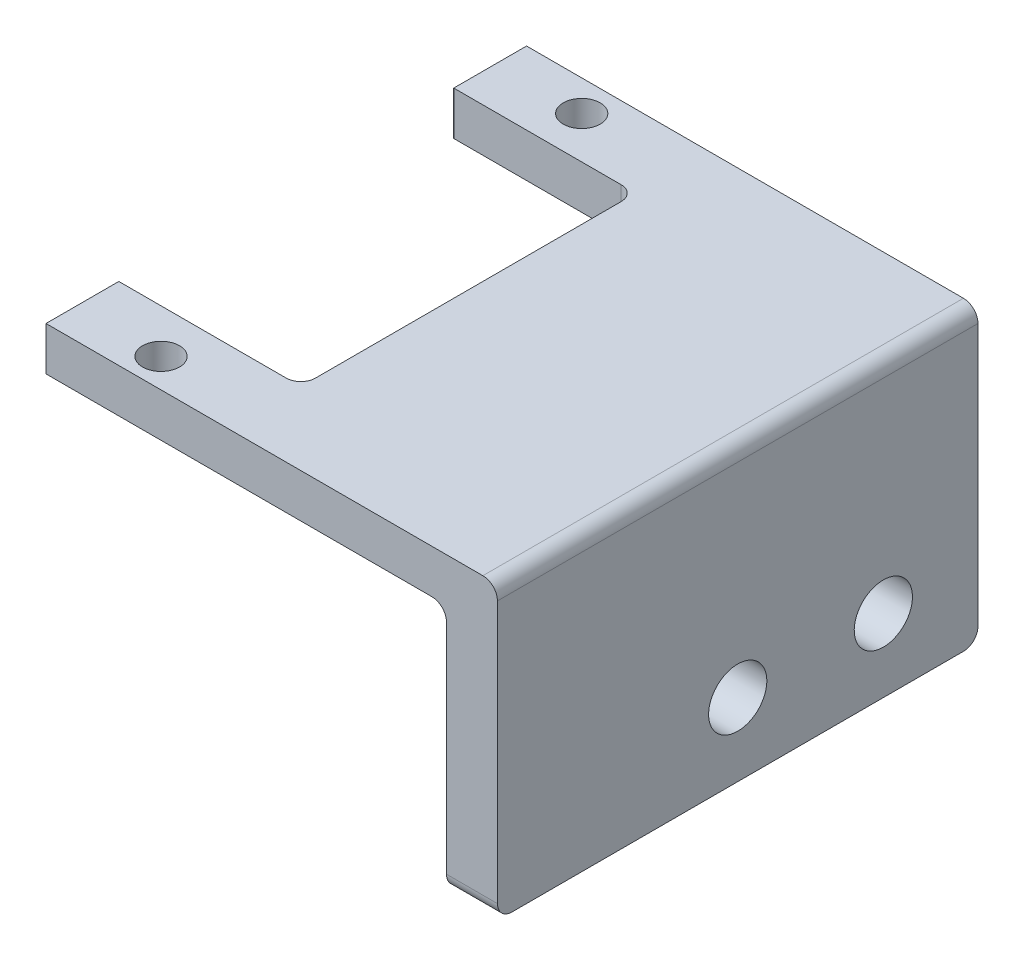
ISO-10303-21;
HEADER;
FILE_DESCRIPTION(('STEP AP214'),'2;1');
FILE_NAME('part.step','',(''),(''),'','','');
FILE_SCHEMA(('AUTOMOTIVE_DESIGN { 1 0 10303 214 1 1 1 1 }'));
ENDSEC;
DATA;
#1=APPLICATION_CONTEXT('core data for automotive mechanical design processes');
#2=APPLICATION_PROTOCOL_DEFINITION('international standard','automotive_design',2000,#1);
#3=PRODUCT_CONTEXT('',#1,'mechanical');
#4=PRODUCT('Part','Part','',(#3));
#5=PRODUCT_RELATED_PRODUCT_CATEGORY('part','',(#4));
#6=PRODUCT_DEFINITION_FORMATION('','',#4);
#7=PRODUCT_DEFINITION_CONTEXT('part definition',#1,'design');
#8=PRODUCT_DEFINITION('design','',#6,#7);
#9=PRODUCT_DEFINITION_SHAPE('','',#8);
#10=(LENGTH_UNIT() NAMED_UNIT(*) SI_UNIT(.MILLI.,.METRE.));
#11=(NAMED_UNIT(*) PLANE_ANGLE_UNIT() SI_UNIT($,.RADIAN.));
#12=(NAMED_UNIT(*) SI_UNIT($,.STERADIAN.) SOLID_ANGLE_UNIT());
#13=UNCERTAINTY_MEASURE_WITH_UNIT(LENGTH_MEASURE(1.E-05),#10,'distance_accuracy_value','');
#14=(GEOMETRIC_REPRESENTATION_CONTEXT(3) GLOBAL_UNCERTAINTY_ASSIGNED_CONTEXT((#13)) GLOBAL_UNIT_ASSIGNED_CONTEXT((#10,
#11,#12)) REPRESENTATION_CONTEXT('',''));
#15=CARTESIAN_POINT('',(0.,0.,0.));
#16=DIRECTION('',(0.,0.,1.));
#17=DIRECTION('',(1.,0.,0.));
#18=AXIS2_PLACEMENT_3D('',#15,#16,#17);
#19=CARTESIAN_POINT('',(12.5,-22.1732019458601,0.));
#20=DIRECTION('',(-1.,0.,0.));
#21=DIRECTION('',(0.,-1.,0.));
#22=AXIS2_PLACEMENT_3D('',#19,#20,#21);
#23=PLANE('',#22);
#24=DIRECTION('',(0.,0.,-1.));
#25=VECTOR('',#24,1.);
#26=CARTESIAN_POINT('',(12.5,-5.17320194586012,33.));
#27=LINE('',#26,#25);
#28=CARTESIAN_POINT('',(12.5,-5.17320194586012,27.));
#29=VERTEX_POINT('',#28);
#30=CARTESIAN_POINT('',(12.5,-5.17320194586012,6.));
#31=VERTEX_POINT('',#30);
#32=EDGE_CURVE('E299',#29,#31,#27,.T.);
#33=ORIENTED_EDGE('',*,*,#32,.F.);
#34=DIRECTION('',(0.,1.,0.));
#35=VECTOR('',#34,1.);
#36=CARTESIAN_POINT('',(12.5,-22.1732019458601,27.));
#37=LINE('',#36,#35);
#38=CARTESIAN_POINT('',(12.5,-2.17320194586011,27.));
#39=VERTEX_POINT('',#38);
#40=EDGE_CURVE('E254',#29,#39,#37,.T.);
#41=ORIENTED_EDGE('',*,*,#40,.T.);
#42=DIRECTION('',(0.,0.,1.));
#43=VECTOR('',#42,1.);
#44=CARTESIAN_POINT('',(12.5,-2.17320194586011,0.));
#45=LINE('',#44,#43);
#46=CARTESIAN_POINT('',(12.5,-2.17320194586011,6.));
#47=VERTEX_POINT('',#46);
#48=EDGE_CURVE('E196',#47,#39,#45,.T.);
#49=ORIENTED_EDGE('',*,*,#48,.F.);
#50=DIRECTION('',(0.,1.,0.));
#51=VECTOR('',#50,1.);
#52=CARTESIAN_POINT('',(12.5,-22.1732019458601,6.));
#53=LINE('',#52,#51);
#54=EDGE_CURVE('E252',#47,#31,#53,.F.);
#55=ORIENTED_EDGE('',*,*,#54,.T.);
#56=EDGE_LOOP('',(#33,#41,#49,#55));
#57=FACE_BOUND('',#56,.T.);
#58=ADVANCED_FACE('F39',(#57),#23,.T.);
#59=CARTESIAN_POINT('',(0.,-2.17320194586011,0.));
#60=DIRECTION('',(0.,1.,0.));
#61=DIRECTION('',(-1.,0.,0.));
#62=AXIS2_PLACEMENT_3D('',#59,#60,#61);
#63=PLANE('',#62);
#64=DIRECTION('',(1.,0.,0.));
#65=VECTOR('',#64,1.);
#66=CARTESIAN_POINT('',(0.,-2.17320194586011,33.));
#67=LINE('',#66,#65);
#68=CARTESIAN_POINT('',(0.,-2.17320194586011,33.));
#69=VERTEX_POINT('',#68);
#70=CARTESIAN_POINT('',(30.,-2.17320194586012,33.));
#71=VERTEX_POINT('',#70);
#72=EDGE_CURVE('E191',#69,#71,#67,.T.);
#73=ORIENTED_EDGE('',*,*,#72,.T.);
#74=DIRECTION('',(0.,0.,1.));
#75=VECTOR('',#74,1.);
#76=CARTESIAN_POINT('',(30.,-2.17320194586012,0.));
#77=LINE('',#76,#75);
#78=CARTESIAN_POINT('',(30.,-2.17320194586012,0.));
#79=VERTEX_POINT('',#78);
#80=EDGE_CURVE('E246',#71,#79,#77,.F.);
#81=ORIENTED_EDGE('',*,*,#80,.T.);
#82=DIRECTION('',(-1.,0.,0.));
#83=VECTOR('',#82,1.);
#84=CARTESIAN_POINT('',(0.,-2.17320194586011,0.));
#85=LINE('',#84,#83);
#86=CARTESIAN_POINT('',(0.,-2.17320194586011,0.));
#87=VERTEX_POINT('',#86);
#88=EDGE_CURVE('E220',#79,#87,#85,.T.);
#89=ORIENTED_EDGE('',*,*,#88,.T.);
#90=DIRECTION('',(0.,0.,1.));
#91=VECTOR('',#90,1.);
#92=CARTESIAN_POINT('',(0.,-2.17320194586011,0.));
#93=LINE('',#92,#91);
#94=CARTESIAN_POINT('',(0.,-2.17320194586011,5.));
#95=VERTEX_POINT('',#94);
#96=EDGE_CURVE('E213',#87,#95,#93,.T.);
#97=ORIENTED_EDGE('',*,*,#96,.T.);
#98=DIRECTION('',(1.,0.,0.));
#99=VECTOR('',#98,1.);
#100=CARTESIAN_POINT('',(0.,-2.17320194586011,5.));
#101=LINE('',#100,#99);
#102=CARTESIAN_POINT('',(11.5,-2.17320194586011,5.));
#103=VERTEX_POINT('',#102);
#104=EDGE_CURVE('E216',#95,#103,#101,.T.);
#105=ORIENTED_EDGE('',*,*,#104,.T.);
#106=CARTESIAN_POINT('',(11.5,-2.17320194586011,6.));
#107=DIRECTION('',(0.,1.,0.));
#108=DIRECTION('',(-1.,0.,0.));
#109=AXIS2_PLACEMENT_3D('',#106,#107,#108);
#110=CIRCLE('',#109,1.);
#111=EDGE_CURVE('E277',#103,#47,#110,.F.);
#112=ORIENTED_EDGE('',*,*,#111,.T.);
#113=ORIENTED_EDGE('',*,*,#48,.T.);
#114=CARTESIAN_POINT('',(11.5,-2.17320194586011,27.));
#115=DIRECTION('',(0.,1.,0.));
#116=DIRECTION('',(-1.,0.,0.));
#117=AXIS2_PLACEMENT_3D('',#114,#115,#116);
#118=CIRCLE('',#117,1.);
#119=CARTESIAN_POINT('',(11.5,-2.17320194586011,28.));
#120=VERTEX_POINT('',#119);
#121=EDGE_CURVE('E273',#39,#120,#118,.F.);
#122=ORIENTED_EDGE('',*,*,#121,.T.);
#123=DIRECTION('',(-1.,0.,0.));
#124=VECTOR('',#123,1.);
#125=CARTESIAN_POINT('',(0.,-2.17320194586011,28.));
#126=LINE('',#125,#124);
#127=CARTESIAN_POINT('',(0.,-2.17320194586011,28.));
#128=VERTEX_POINT('',#127);
#129=EDGE_CURVE('E173',#120,#128,#126,.T.);
#130=ORIENTED_EDGE('',*,*,#129,.T.);
#131=DIRECTION('',(0.,0.,1.));
#132=VECTOR('',#131,1.);
#133=CARTESIAN_POINT('',(0.,-2.17320194586011,28.));
#134=LINE('',#133,#132);
#135=EDGE_CURVE('E165',#128,#69,#134,.T.);
#136=ORIENTED_EDGE('',*,*,#135,.T.);
#137=EDGE_LOOP('',(#73,#81,#89,#97,#105,#112,#113,#122,#130,#136));
#138=FACE_BOUND('',#137,.T.);
#139=CARTESIAN_POINT('',(5.90643397731527,-2.17320194586011,31.0075194618769));
#140=DIRECTION('',(0.,1.,0.));
#141=DIRECTION('',(-1.,0.,0.));
#142=AXIS2_PLACEMENT_3D('',#139,#140,#141);
#143=CIRCLE('',#142,1.27);
#144=CARTESIAN_POINT('',(4.63643397731528,-2.17320194586011,31.0075194618769));
#145=VERTEX_POINT('',#144);
#146=EDGE_CURVE('E181',#145,#145,#143,.T.);
#147=ORIENTED_EDGE('',*,*,#146,.F.);
#148=EDGE_LOOP('',(#147));
#149=FACE_BOUND('',#148,.T.);
#150=CARTESIAN_POINT('',(5.90643397731527,-2.17320194586011,2.11948053812313));
#151=DIRECTION('',(0.,1.,0.));
#152=DIRECTION('',(-1.,0.,0.));
#153=AXIS2_PLACEMENT_3D('',#150,#151,#152);
#154=CIRCLE('',#153,1.27);
#155=CARTESIAN_POINT('',(4.63643397731527,-2.17320194586011,2.11948053812313));
#156=VERTEX_POINT('',#155);
#157=EDGE_CURVE('E207',#156,#156,#154,.T.);
#158=ORIENTED_EDGE('',*,*,#157,.F.);
#159=EDGE_LOOP('',(#158));
#160=FACE_BOUND('',#159,.T.);
#161=ADVANCED_FACE('F313',(#138,#149,#160),#63,.T.);
#162=CARTESIAN_POINT('',(0.,-5.17320194586011,0.));
#163=DIRECTION('',(0.,1.,0.));
#164=DIRECTION('',(-1.,0.,0.));
#165=AXIS2_PLACEMENT_3D('',#162,#163,#164);
#166=PLANE('',#165);
#167=DIRECTION('',(-1.,0.,0.));
#168=VECTOR('',#167,1.);
#169=CARTESIAN_POINT('',(0.,-5.17320194586011,0.));
#170=LINE('',#169,#168);
#171=CARTESIAN_POINT('',(26.5,-5.17320194586012,0.));
#172=VERTEX_POINT('',#171);
#173=CARTESIAN_POINT('',(0.,-5.17320194586011,0.));
#174=VERTEX_POINT('',#173);
#175=EDGE_CURVE('E217',#172,#174,#170,.T.);
#176=ORIENTED_EDGE('',*,*,#175,.F.);
#177=DIRECTION('',(0.,0.,-1.));
#178=VECTOR('',#177,1.);
#179=CARTESIAN_POINT('',(26.5,-5.17320194586012,33.));
#180=LINE('',#179,#178);
#181=CARTESIAN_POINT('',(26.5,-5.17320194586012,33.));
#182=VERTEX_POINT('',#181);
#183=EDGE_CURVE('E271',#172,#182,#180,.F.);
#184=ORIENTED_EDGE('',*,*,#183,.T.);
#185=DIRECTION('',(1.,0.,0.));
#186=VECTOR('',#185,1.);
#187=CARTESIAN_POINT('',(0.,-5.17320194586011,33.));
#188=LINE('',#187,#186);
#189=CARTESIAN_POINT('',(0.,-5.17320194586011,33.));
#190=VERTEX_POINT('',#189);
#191=EDGE_CURVE('E164',#190,#182,#188,.T.);
#192=ORIENTED_EDGE('',*,*,#191,.F.);
#193=DIRECTION('',(0.,0.,1.));
#194=VECTOR('',#193,1.);
#195=CARTESIAN_POINT('',(0.,-5.17320194586011,28.));
#196=LINE('',#195,#194);
#197=CARTESIAN_POINT('',(0.,-5.17320194586011,28.));
#198=VERTEX_POINT('',#197);
#199=EDGE_CURVE('E171',#198,#190,#196,.T.);
#200=ORIENTED_EDGE('',*,*,#199,.F.);
#201=DIRECTION('',(-1.,0.,0.));
#202=VECTOR('',#201,1.);
#203=CARTESIAN_POINT('',(0.,-5.17320194586011,28.));
#204=LINE('',#203,#202);
#205=CARTESIAN_POINT('',(11.5,-5.17320194586011,28.));
#206=VERTEX_POINT('',#205);
#207=EDGE_CURVE('E153',#206,#198,#204,.T.);
#208=ORIENTED_EDGE('',*,*,#207,.F.);
#209=CARTESIAN_POINT('',(11.5,-5.17320194586011,27.));
#210=DIRECTION('',(0.,1.,0.));
#211=DIRECTION('',(-1.,0.,0.));
#212=AXIS2_PLACEMENT_3D('',#209,#210,#211);
#213=CIRCLE('',#212,1.);
#214=EDGE_CURVE('E275',#206,#29,#213,.T.);
#215=ORIENTED_EDGE('',*,*,#214,.T.);
#216=ORIENTED_EDGE('',*,*,#32,.T.);
#217=CARTESIAN_POINT('',(11.5,-5.17320194586011,6.));
#218=DIRECTION('',(0.,1.,0.));
#219=DIRECTION('',(-1.,0.,0.));
#220=AXIS2_PLACEMENT_3D('',#217,#218,#219);
#221=CIRCLE('',#220,1.);
#222=CARTESIAN_POINT('',(11.5,-5.17320194586011,5.));
#223=VERTEX_POINT('',#222);
#224=EDGE_CURVE('E279',#31,#223,#221,.T.);
#225=ORIENTED_EDGE('',*,*,#224,.T.);
#226=DIRECTION('',(1.,0.,0.));
#227=VECTOR('',#226,1.);
#228=CARTESIAN_POINT('',(0.,-5.17320194586011,5.));
#229=LINE('',#228,#227);
#230=CARTESIAN_POINT('',(0.,-5.17320194586011,5.));
#231=VERTEX_POINT('',#230);
#232=EDGE_CURVE('E225',#231,#223,#229,.T.);
#233=ORIENTED_EDGE('',*,*,#232,.F.);
#234=DIRECTION('',(0.,0.,1.));
#235=VECTOR('',#234,1.);
#236=CARTESIAN_POINT('',(0.,-5.17320194586011,0.));
#237=LINE('',#236,#235);
#238=EDGE_CURVE('E210',#174,#231,#237,.T.);
#239=ORIENTED_EDGE('',*,*,#238,.F.);
#240=EDGE_LOOP('',(#176,#184,#192,#200,#208,#215,#216,#225,#233,#239));
#241=FACE_BOUND('',#240,.T.);
#242=CARTESIAN_POINT('',(5.90643397731527,-5.17320194586011,2.11948053812313));
#243=DIRECTION('',(0.,1.,0.));
#244=DIRECTION('',(-1.,0.,0.));
#245=AXIS2_PLACEMENT_3D('',#242,#243,#244);
#246=CIRCLE('',#245,1.27);
#247=CARTESIAN_POINT('',(4.63643397731527,-5.17320194586011,2.11948053812313));
#248=VERTEX_POINT('',#247);
#249=EDGE_CURVE('E204',#248,#248,#246,.T.);
#250=ORIENTED_EDGE('',*,*,#249,.T.);
#251=EDGE_LOOP('',(#250));
#252=FACE_BOUND('',#251,.T.);
#253=CARTESIAN_POINT('',(5.90643397731527,-5.17320194586011,31.0075194618769));
#254=DIRECTION('',(0.,1.,0.));
#255=DIRECTION('',(-1.,0.,0.));
#256=AXIS2_PLACEMENT_3D('',#253,#254,#255);
#257=CIRCLE('',#256,1.27);
#258=CARTESIAN_POINT('',(4.63643397731528,-5.17320194586011,31.0075194618769));
#259=VERTEX_POINT('',#258);
#260=EDGE_CURVE('E184',#259,#259,#257,.T.);
#261=ORIENTED_EDGE('',*,*,#260,.T.);
#262=EDGE_LOOP('',(#261));
#263=FACE_BOUND('',#262,.T.);
#264=ADVANCED_FACE('F177',(#241,#252,#263),#166,.F.);
#265=CARTESIAN_POINT('',(0.,-2.17320194586011,0.));
#266=DIRECTION('',(1.,0.,0.));
#267=DIRECTION('',(0.,1.,0.));
#268=AXIS2_PLACEMENT_3D('',#265,#266,#267);
#269=PLANE('',#268);
#270=ORIENTED_EDGE('',*,*,#238,.T.);
#271=DIRECTION('',(0.,-1.,0.));
#272=VECTOR('',#271,1.);
#273=CARTESIAN_POINT('',(0.,-2.17320194586011,5.));
#274=LINE('',#273,#272);
#275=EDGE_CURVE('E231',#95,#231,#274,.T.);
#276=ORIENTED_EDGE('',*,*,#275,.F.);
#277=ORIENTED_EDGE('',*,*,#96,.F.);
#278=DIRECTION('',(0.,-1.,0.));
#279=VECTOR('',#278,1.);
#280=CARTESIAN_POINT('',(0.,-2.17320194586011,0.));
#281=LINE('',#280,#279);
#282=EDGE_CURVE('E222',#87,#174,#281,.T.);
#283=ORIENTED_EDGE('',*,*,#282,.T.);
#284=EDGE_LOOP('',(#270,#276,#277,#283));
#285=FACE_BOUND('',#284,.T.);
#286=ADVANCED_FACE('F331',(#285),#269,.F.);
#287=CARTESIAN_POINT('',(0.,-2.17320194586011,5.));
#288=DIRECTION('',(0.,0.,-1.));
#289=DIRECTION('',(-1.,0.,0.));
#290=AXIS2_PLACEMENT_3D('',#287,#288,#289);
#291=PLANE('',#290);
#292=ORIENTED_EDGE('',*,*,#232,.T.);
#293=DIRECTION('',(0.,1.,0.));
#294=VECTOR('',#293,1.);
#295=CARTESIAN_POINT('',(11.5,-2.17320194586011,5.));
#296=LINE('',#295,#294);
#297=EDGE_CURVE('E258',#223,#103,#296,.T.);
#298=ORIENTED_EDGE('',*,*,#297,.T.);
#299=ORIENTED_EDGE('',*,*,#104,.F.);
#300=ORIENTED_EDGE('',*,*,#275,.T.);
#301=EDGE_LOOP('',(#292,#298,#299,#300));
#302=FACE_BOUND('',#301,.T.);
#303=ADVANCED_FACE('F327',(#302),#291,.F.);
#304=CARTESIAN_POINT('',(0.,-2.17320194586011,0.));
#305=DIRECTION('',(0.,0.,1.));
#306=DIRECTION('',(1.,0.,0.));
#307=AXIS2_PLACEMENT_3D('',#304,#305,#306);
#308=PLANE('',#307);
#309=ORIENTED_EDGE('',*,*,#88,.F.);
#310=CARTESIAN_POINT('',(30.,-3.17320194586012,0.));
#311=DIRECTION('',(0.,0.,1.));
#312=DIRECTION('',(1.,0.,0.));
#313=AXIS2_PLACEMENT_3D('',#310,#311,#312);
#314=CIRCLE('',#313,1.);
#315=CARTESIAN_POINT('',(31.,-3.17320194586012,0.));
#316=VERTEX_POINT('',#315);
#317=EDGE_CURVE('E250',#79,#316,#314,.F.);
#318=ORIENTED_EDGE('',*,*,#317,.T.);
#319=DIRECTION('',(0.,1.,0.));
#320=VECTOR('',#319,1.);
#321=CARTESIAN_POINT('',(31.,-22.1732019458601,0.));
#322=LINE('',#321,#320);
#323=CARTESIAN_POINT('',(31.,-21.1732019458601,0.));
#324=VERTEX_POINT('',#323);
#325=EDGE_CURVE('E201',#324,#316,#322,.T.);
#326=ORIENTED_EDGE('',*,*,#325,.F.);
#327=DIRECTION('',(1.,0.,0.));
#328=VECTOR('',#327,1.);
#329=CARTESIAN_POINT('',(0.,-21.1732019458601,0.));
#330=LINE('',#329,#328);
#331=CARTESIAN_POINT('',(27.5,-21.1732019458601,0.));
#332=VERTEX_POINT('',#331);
#333=EDGE_CURVE('E248',#324,#332,#330,.F.);
#334=ORIENTED_EDGE('',*,*,#333,.T.);
#335=DIRECTION('',(0.,-1.,0.));
#336=VECTOR('',#335,1.);
#337=CARTESIAN_POINT('',(27.5,-22.1732019458601,0.));
#338=LINE('',#337,#336);
#339=CARTESIAN_POINT('',(27.5,-6.17320194586012,0.));
#340=VERTEX_POINT('',#339);
#341=EDGE_CURVE('E285',#340,#332,#338,.T.);
#342=ORIENTED_EDGE('',*,*,#341,.F.);
#343=CARTESIAN_POINT('',(26.5,-6.17320194586012,0.));
#344=DIRECTION('',(0.,0.,1.));
#345=DIRECTION('',(1.,0.,0.));
#346=AXIS2_PLACEMENT_3D('',#343,#344,#345);
#347=CIRCLE('',#346,1.);
#348=EDGE_CURVE('E47',#340,#172,#347,.T.);
#349=ORIENTED_EDGE('',*,*,#348,.T.);
#350=ORIENTED_EDGE('',*,*,#175,.T.);
#351=ORIENTED_EDGE('',*,*,#282,.F.);
#352=EDGE_LOOP('',(#309,#318,#326,#334,#342,#349,#350,#351));
#353=FACE_BOUND('',#352,.T.);
#354=ADVANCED_FACE('F283',(#353),#308,.F.);
#355=CARTESIAN_POINT('',(5.90643397731527,-2.17320194586011,2.11948053812313));
#356=DIRECTION('',(0.,-1.,0.));
#357=DIRECTION('',(1.,0.,0.));
#358=AXIS2_PLACEMENT_3D('',#355,#356,#357);
#359=CYLINDRICAL_SURFACE('',#358,1.27);
#360=ORIENTED_EDGE('',*,*,#157,.T.);
#361=EDGE_LOOP('',(#360));
#362=FACE_BOUND('',#361,.T.);
#363=ORIENTED_EDGE('',*,*,#249,.F.);
#364=EDGE_LOOP('',(#363));
#365=FACE_BOUND('',#364,.T.);
#366=ADVANCED_FACE('F369',(#362,#365),#359,.F.);
#367=CARTESIAN_POINT('',(0.,-22.1732019458601,33.));
#368=DIRECTION('',(0.,0.,1.));
#369=DIRECTION('',(0.,-1.,0.));
#370=AXIS2_PLACEMENT_3D('',#367,#368,#369);
#371=PLANE('',#370);
#372=DIRECTION('',(0.,1.,0.));
#373=VECTOR('',#372,1.);
#374=CARTESIAN_POINT('',(31.,-22.1732019458601,33.));
#375=LINE('',#374,#373);
#376=CARTESIAN_POINT('',(31.,-21.1732019458601,33.));
#377=VERTEX_POINT('',#376);
#378=CARTESIAN_POINT('',(31.,-3.17320194586012,33.));
#379=VERTEX_POINT('',#378);
#380=EDGE_CURVE('E195',#377,#379,#375,.T.);
#381=ORIENTED_EDGE('',*,*,#380,.T.);
#382=CARTESIAN_POINT('',(30.,-3.17320194586012,33.));
#383=DIRECTION('',(0.,0.,1.));
#384=DIRECTION('',(0.,-1.,0.));
#385=AXIS2_PLACEMENT_3D('',#382,#383,#384);
#386=CIRCLE('',#385,1.);
#387=EDGE_CURVE('E244',#379,#71,#386,.T.);
#388=ORIENTED_EDGE('',*,*,#387,.T.);
#389=ORIENTED_EDGE('',*,*,#72,.F.);
#390=DIRECTION('',(0.,-1.,0.));
#391=VECTOR('',#390,1.);
#392=CARTESIAN_POINT('',(0.,-2.17320194586011,33.));
#393=LINE('',#392,#391);
#394=EDGE_CURVE('E174',#69,#190,#393,.T.);
#395=ORIENTED_EDGE('',*,*,#394,.T.);
#396=ORIENTED_EDGE('',*,*,#191,.T.);
#397=CARTESIAN_POINT('',(26.5,-6.17320194586012,33.));
#398=DIRECTION('',(0.,0.,1.));
#399=DIRECTION('',(0.,-1.,0.));
#400=AXIS2_PLACEMENT_3D('',#397,#398,#399);
#401=CIRCLE('',#400,1.);
#402=CARTESIAN_POINT('',(27.5,-6.17320194586012,33.));
#403=VERTEX_POINT('',#402);
#404=EDGE_CURVE('E11',#182,#403,#401,.F.);
#405=ORIENTED_EDGE('',*,*,#404,.T.);
#406=DIRECTION('',(0.,-1.,0.));
#407=VECTOR('',#406,1.);
#408=CARTESIAN_POINT('',(27.5,-22.1732019458601,33.));
#409=LINE('',#408,#407);
#410=CARTESIAN_POINT('',(27.5,-21.1732019458601,33.));
#411=VERTEX_POINT('',#410);
#412=EDGE_CURVE('E295',#403,#411,#409,.T.);
#413=ORIENTED_EDGE('',*,*,#412,.T.);
#414=DIRECTION('',(1.,0.,0.));
#415=VECTOR('',#414,1.);
#416=CARTESIAN_POINT('',(31.,-21.1732019458601,33.));
#417=LINE('',#416,#415);
#418=EDGE_CURVE('E241',#411,#377,#417,.T.);
#419=ORIENTED_EDGE('',*,*,#418,.T.);
#420=EDGE_LOOP('',(#381,#388,#389,#395,#396,#405,#413,#419));
#421=FACE_BOUND('',#420,.T.);
#422=ADVANCED_FACE('F294',(#421),#371,.T.);
#423=CARTESIAN_POINT('',(31.,-22.1732019458601,0.));
#424=DIRECTION('',(-1.,0.,0.));
#425=DIRECTION('',(0.,-1.,0.));
#426=AXIS2_PLACEMENT_3D('',#423,#424,#425);
#427=PLANE('',#426);
#428=CARTESIAN_POINT('',(31.,-17.1732019458601,16.5));
#429=DIRECTION('',(-1.,0.,0.));
#430=DIRECTION('',(0.,-1.,0.));
#431=AXIS2_PLACEMENT_3D('',#428,#429,#430);
#432=CIRCLE('',#431,2.00000000000001);
#433=CARTESIAN_POINT('',(31.,-19.1732019458601,16.5));
#434=VERTEX_POINT('',#433);
#435=EDGE_CURVE('E304',#434,#434,#432,.T.);
#436=ORIENTED_EDGE('',*,*,#435,.T.);
#437=EDGE_LOOP('',(#436));
#438=FACE_BOUND('',#437,.T.);
#439=CARTESIAN_POINT('',(31.,-17.1732019458601,6.5));
#440=DIRECTION('',(-1.,0.,0.));
#441=DIRECTION('',(0.,-1.,0.));
#442=AXIS2_PLACEMENT_3D('',#439,#440,#441);
#443=CIRCLE('',#442,2.);
#444=CARTESIAN_POINT('',(31.,-19.1732019458601,6.5));
#445=VERTEX_POINT('',#444);
#446=EDGE_CURVE('E307',#445,#445,#443,.T.);
#447=ORIENTED_EDGE('',*,*,#446,.T.);
#448=EDGE_LOOP('',(#447));
#449=FACE_BOUND('',#448,.T.);
#450=ORIENTED_EDGE('',*,*,#325,.T.);
#451=DIRECTION('',(0.,0.,1.));
#452=VECTOR('',#451,1.);
#453=CARTESIAN_POINT('',(31.,-3.17320194586012,33.));
#454=LINE('',#453,#452);
#455=EDGE_CURVE('E238',#316,#379,#454,.T.);
#456=ORIENTED_EDGE('',*,*,#455,.T.);
#457=ORIENTED_EDGE('',*,*,#380,.F.);
#458=CARTESIAN_POINT('',(31.,-21.1732019458601,32.));
#459=DIRECTION('',(-1.,0.,0.));
#460=DIRECTION('',(0.,-1.,0.));
#461=AXIS2_PLACEMENT_3D('',#458,#459,#460);
#462=CIRCLE('',#461,1.);
#463=CARTESIAN_POINT('',(31.,-22.1732019458601,32.));
#464=VERTEX_POINT('',#463);
#465=EDGE_CURVE('E234',#377,#464,#462,.F.);
#466=ORIENTED_EDGE('',*,*,#465,.T.);
#467=DIRECTION('',(0.,0.,1.));
#468=VECTOR('',#467,1.);
#469=CARTESIAN_POINT('',(31.,-22.1732019458601,0.));
#470=LINE('',#469,#468);
#471=CARTESIAN_POINT('',(31.,-22.1732019458601,1.));
#472=VERTEX_POINT('',#471);
#473=EDGE_CURVE('E193',#472,#464,#470,.T.);
#474=ORIENTED_EDGE('',*,*,#473,.F.);
#475=CARTESIAN_POINT('',(31.,-21.1732019458601,1.));
#476=DIRECTION('',(-1.,0.,0.));
#477=DIRECTION('',(0.,-1.,0.));
#478=AXIS2_PLACEMENT_3D('',#475,#476,#477);
#479=CIRCLE('',#478,1.);
#480=EDGE_CURVE('E236',#472,#324,#479,.F.);
#481=ORIENTED_EDGE('',*,*,#480,.T.);
#482=EDGE_LOOP('',(#450,#456,#457,#466,#474,#481));
#483=FACE_BOUND('',#482,.T.);
#484=ADVANCED_FACE('F339',(#438,#449,#483),#427,.F.);
#485=CARTESIAN_POINT('',(0.,-22.1732019458601,0.));
#486=DIRECTION('',(0.,1.,0.));
#487=DIRECTION('',(-1.,0.,0.));
#488=AXIS2_PLACEMENT_3D('',#485,#486,#487);
#489=PLANE('',#488);
#490=DIRECTION('',(0.,0.,-1.));
#491=VECTOR('',#490,1.);
#492=CARTESIAN_POINT('',(27.5,-22.1732019458601,33.));
#493=LINE('',#492,#491);
#494=CARTESIAN_POINT('',(27.5,-22.1732019458601,32.));
#495=VERTEX_POINT('',#494);
#496=CARTESIAN_POINT('',(27.5,-22.1732019458601,1.));
#497=VERTEX_POINT('',#496);
#498=EDGE_CURVE('E302',#495,#497,#493,.T.);
#499=ORIENTED_EDGE('',*,*,#498,.T.);
#500=DIRECTION('',(1.,0.,0.));
#501=VECTOR('',#500,1.);
#502=CARTESIAN_POINT('',(0.,-22.1732019458601,1.));
#503=LINE('',#502,#501);
#504=EDGE_CURVE('E262',#497,#472,#503,.T.);
#505=ORIENTED_EDGE('',*,*,#504,.T.);
#506=ORIENTED_EDGE('',*,*,#473,.T.);
#507=DIRECTION('',(1.,0.,0.));
#508=VECTOR('',#507,1.);
#509=CARTESIAN_POINT('',(27.5,-22.1732019458601,32.));
#510=LINE('',#509,#508);
#511=EDGE_CURVE('E61',#464,#495,#510,.F.);
#512=ORIENTED_EDGE('',*,*,#511,.T.);
#513=EDGE_LOOP('',(#499,#505,#506,#512));
#514=FACE_BOUND('',#513,.T.);
#515=ADVANCED_FACE('F343',(#514),#489,.F.);
#516=CARTESIAN_POINT('',(0.,-2.17320194586011,28.));
#517=DIRECTION('',(1.,0.,0.));
#518=DIRECTION('',(0.,1.,0.));
#519=AXIS2_PLACEMENT_3D('',#516,#517,#518);
#520=PLANE('',#519);
#521=ORIENTED_EDGE('',*,*,#199,.T.);
#522=ORIENTED_EDGE('',*,*,#394,.F.);
#523=ORIENTED_EDGE('',*,*,#135,.F.);
#524=DIRECTION('',(0.,-1.,0.));
#525=VECTOR('',#524,1.);
#526=CARTESIAN_POINT('',(0.,-2.17320194586011,28.));
#527=LINE('',#526,#525);
#528=EDGE_CURVE('E157',#128,#198,#527,.T.);
#529=ORIENTED_EDGE('',*,*,#528,.T.);
#530=EDGE_LOOP('',(#521,#522,#523,#529));
#531=FACE_BOUND('',#530,.T.);
#532=ADVANCED_FACE('F169',(#531),#520,.F.);
#533=CARTESIAN_POINT('',(0.,-2.17320194586011,28.));
#534=DIRECTION('',(0.,0.,1.));
#535=DIRECTION('',(1.,0.,0.));
#536=AXIS2_PLACEMENT_3D('',#533,#534,#535);
#537=PLANE('',#536);
#538=ORIENTED_EDGE('',*,*,#129,.F.);
#539=DIRECTION('',(0.,1.,0.));
#540=VECTOR('',#539,1.);
#541=CARTESIAN_POINT('',(11.5,-2.17320194586011,28.));
#542=LINE('',#541,#540);
#543=EDGE_CURVE('E160',#120,#206,#542,.F.);
#544=ORIENTED_EDGE('',*,*,#543,.T.);
#545=ORIENTED_EDGE('',*,*,#207,.T.);
#546=ORIENTED_EDGE('',*,*,#528,.F.);
#547=EDGE_LOOP('',(#538,#544,#545,#546));
#548=FACE_BOUND('',#547,.T.);
#549=ADVANCED_FACE('F156',(#548),#537,.F.);
#550=CARTESIAN_POINT('',(5.90643397731527,-2.17320194586011,31.0075194618769));
#551=DIRECTION('',(0.,-1.,0.));
#552=DIRECTION('',(1.,0.,0.));
#553=AXIS2_PLACEMENT_3D('',#550,#551,#552);
#554=CYLINDRICAL_SURFACE('',#553,1.27);
#555=ORIENTED_EDGE('',*,*,#146,.T.);
#556=EDGE_LOOP('',(#555));
#557=FACE_BOUND('',#556,.T.);
#558=ORIENTED_EDGE('',*,*,#260,.F.);
#559=EDGE_LOOP('',(#558));
#560=FACE_BOUND('',#559,.T.);
#561=ADVANCED_FACE('F455',(#557,#560),#554,.F.);
#562=CARTESIAN_POINT('',(27.5,-22.1732019458601,33.));
#563=DIRECTION('',(1.,0.,0.));
#564=DIRECTION('',(0.,1.,0.));
#565=AXIS2_PLACEMENT_3D('',#562,#563,#564);
#566=PLANE('',#565);
#567=CARTESIAN_POINT('',(27.5,-17.1732019458601,16.5));
#568=DIRECTION('',(-1.,0.,0.));
#569=DIRECTION('',(0.,-1.,0.));
#570=AXIS2_PLACEMENT_3D('',#567,#568,#569);
#571=CIRCLE('',#570,2.00000000000001);
#572=CARTESIAN_POINT('',(27.5,-19.1732019458601,16.5));
#573=VERTEX_POINT('',#572);
#574=EDGE_CURVE('E626',#573,#573,#571,.T.);
#575=ORIENTED_EDGE('',*,*,#574,.F.);
#576=EDGE_LOOP('',(#575));
#577=FACE_BOUND('',#576,.T.);
#578=CARTESIAN_POINT('',(27.5,-17.1732019458601,6.5));
#579=DIRECTION('',(-1.,0.,0.));
#580=DIRECTION('',(0.,-1.,0.));
#581=AXIS2_PLACEMENT_3D('',#578,#579,#580);
#582=CIRCLE('',#581,2.);
#583=CARTESIAN_POINT('',(27.5,-19.1732019458601,6.5));
#584=VERTEX_POINT('',#583);
#585=EDGE_CURVE('E629',#584,#584,#582,.T.);
#586=ORIENTED_EDGE('',*,*,#585,.F.);
#587=EDGE_LOOP('',(#586));
#588=FACE_BOUND('',#587,.T.);
#589=ORIENTED_EDGE('',*,*,#341,.T.);
#590=CARTESIAN_POINT('',(27.5,-21.1732019458601,1.));
#591=DIRECTION('',(1.,0.,0.));
#592=DIRECTION('',(0.,1.,0.));
#593=AXIS2_PLACEMENT_3D('',#590,#591,#592);
#594=CIRCLE('',#593,1.);
#595=EDGE_CURVE('E54',#332,#497,#594,.F.);
#596=ORIENTED_EDGE('',*,*,#595,.T.);
#597=ORIENTED_EDGE('',*,*,#498,.F.);
#598=CARTESIAN_POINT('',(27.5,-21.1732019458601,32.));
#599=DIRECTION('',(1.,0.,0.));
#600=DIRECTION('',(0.,1.,0.));
#601=AXIS2_PLACEMENT_3D('',#598,#599,#600);
#602=CIRCLE('',#601,1.);
#603=EDGE_CURVE('E268',#495,#411,#602,.F.);
#604=ORIENTED_EDGE('',*,*,#603,.T.);
#605=ORIENTED_EDGE('',*,*,#412,.F.);
#606=DIRECTION('',(0.,0.,-1.));
#607=VECTOR('',#606,1.);
#608=CARTESIAN_POINT('',(27.5,-6.17320194586012,0.));
#609=LINE('',#608,#607);
#610=EDGE_CURVE('E265',#403,#340,#609,.T.);
#611=ORIENTED_EDGE('',*,*,#610,.T.);
#612=EDGE_LOOP('',(#589,#596,#597,#604,#605,#611));
#613=FACE_BOUND('',#612,.T.);
#614=ADVANCED_FACE('F297',(#577,#588,#613),#566,.F.);
#615=CARTESIAN_POINT('',(31.,-17.1732019458601,6.5));
#616=DIRECTION('',(-1.,0.,0.));
#617=DIRECTION('',(0.,-1.,0.));
#618=AXIS2_PLACEMENT_3D('',#615,#616,#617);
#619=CYLINDRICAL_SURFACE('',#618,2.);
#620=ORIENTED_EDGE('',*,*,#446,.F.);
#621=EDGE_LOOP('',(#620));
#622=FACE_BOUND('',#621,.T.);
#623=ORIENTED_EDGE('',*,*,#585,.T.);
#624=EDGE_LOOP('',(#623));
#625=FACE_BOUND('',#624,.T.);
#626=ADVANCED_FACE('F436',(#622,#625),#619,.F.);
#627=CARTESIAN_POINT('',(31.,-17.1732019458601,16.5));
#628=DIRECTION('',(-1.,0.,0.));
#629=DIRECTION('',(0.,-1.,0.));
#630=AXIS2_PLACEMENT_3D('',#627,#628,#629);
#631=CYLINDRICAL_SURFACE('',#630,2.00000000000001);
#632=ORIENTED_EDGE('',*,*,#435,.F.);
#633=EDGE_LOOP('',(#632));
#634=FACE_BOUND('',#633,.T.);
#635=ORIENTED_EDGE('',*,*,#574,.T.);
#636=EDGE_LOOP('',(#635));
#637=FACE_BOUND('',#636,.T.);
#638=ADVANCED_FACE('F383',(#634,#637),#631,.F.);
#639=CARTESIAN_POINT('',(30.,-3.17320194586012,0.));
#640=DIRECTION('',(0.,0.,-1.));
#641=DIRECTION('',(-1.,0.,0.));
#642=AXIS2_PLACEMENT_3D('',#639,#640,#641);
#643=CYLINDRICAL_SURFACE('',#642,1.);
#644=ORIENTED_EDGE('',*,*,#317,.F.);
#645=ORIENTED_EDGE('',*,*,#80,.F.);
#646=ORIENTED_EDGE('',*,*,#387,.F.);
#647=ORIENTED_EDGE('',*,*,#455,.F.);
#648=EDGE_LOOP('',(#644,#645,#646,#647));
#649=FACE_BOUND('',#648,.T.);
#650=ADVANCED_FACE('F336',(#649),#643,.T.);
#651=CARTESIAN_POINT('',(11.5,-22.1732019458601,27.));
#652=DIRECTION('',(0.,1.,0.));
#653=DIRECTION('',(-1.,0.,0.));
#654=AXIS2_PLACEMENT_3D('',#651,#652,#653);
#655=CYLINDRICAL_SURFACE('',#654,1.);
#656=ORIENTED_EDGE('',*,*,#214,.F.);
#657=ORIENTED_EDGE('',*,*,#543,.F.);
#658=ORIENTED_EDGE('',*,*,#121,.F.);
#659=ORIENTED_EDGE('',*,*,#40,.F.);
#660=EDGE_LOOP('',(#656,#657,#658,#659));
#661=FACE_BOUND('',#660,.T.);
#662=ADVANCED_FACE('F316',(#661),#655,.F.);
#663=CARTESIAN_POINT('',(11.5,-2.17320194586011,6.));
#664=DIRECTION('',(0.,1.,0.));
#665=DIRECTION('',(-1.,0.,0.));
#666=AXIS2_PLACEMENT_3D('',#663,#664,#665);
#667=CYLINDRICAL_SURFACE('',#666,1.);
#668=ORIENTED_EDGE('',*,*,#224,.F.);
#669=ORIENTED_EDGE('',*,*,#54,.F.);
#670=ORIENTED_EDGE('',*,*,#111,.F.);
#671=ORIENTED_EDGE('',*,*,#297,.F.);
#672=EDGE_LOOP('',(#668,#669,#670,#671));
#673=FACE_BOUND('',#672,.T.);
#674=ADVANCED_FACE('F324',(#673),#667,.F.);
#675=CARTESIAN_POINT('',(0.,-21.1732019458601,1.));
#676=DIRECTION('',(1.,0.,0.));
#677=DIRECTION('',(0.,1.,0.));
#678=AXIS2_PLACEMENT_3D('',#675,#676,#677);
#679=CYLINDRICAL_SURFACE('',#678,1.);
#680=ORIENTED_EDGE('',*,*,#595,.F.);
#681=ORIENTED_EDGE('',*,*,#333,.F.);
#682=ORIENTED_EDGE('',*,*,#480,.F.);
#683=ORIENTED_EDGE('',*,*,#504,.F.);
#684=EDGE_LOOP('',(#680,#681,#682,#683));
#685=FACE_BOUND('',#684,.T.);
#686=ADVANCED_FACE('F346',(#685),#679,.T.);
#687=CARTESIAN_POINT('',(0.,-21.1732019458601,32.));
#688=DIRECTION('',(-1.,0.,0.));
#689=DIRECTION('',(0.,-1.,0.));
#690=AXIS2_PLACEMENT_3D('',#687,#688,#689);
#691=CYLINDRICAL_SURFACE('',#690,1.);
#692=ORIENTED_EDGE('',*,*,#603,.F.);
#693=ORIENTED_EDGE('',*,*,#511,.F.);
#694=ORIENTED_EDGE('',*,*,#465,.F.);
#695=ORIENTED_EDGE('',*,*,#418,.F.);
#696=EDGE_LOOP('',(#692,#693,#694,#695));
#697=FACE_BOUND('',#696,.T.);
#698=ADVANCED_FACE('F341',(#697),#691,.T.);
#699=CARTESIAN_POINT('',(26.5,-6.17320194586012,33.));
#700=DIRECTION('',(0.,0.,1.));
#701=DIRECTION('',(0.,-1.,0.));
#702=AXIS2_PLACEMENT_3D('',#699,#700,#701);
#703=CYLINDRICAL_SURFACE('',#702,1.);
#704=ORIENTED_EDGE('',*,*,#404,.F.);
#705=ORIENTED_EDGE('',*,*,#183,.F.);
#706=ORIENTED_EDGE('',*,*,#348,.F.);
#707=ORIENTED_EDGE('',*,*,#610,.F.);
#708=EDGE_LOOP('',(#704,#705,#706,#707));
#709=FACE_BOUND('',#708,.T.);
#710=ADVANCED_FACE('F41',(#709),#703,.F.);
#711=CLOSED_SHELL('',(#58,#161,#264,#286,#303,#354,#366,#422,#484,#515,#532,#549,#561,#614,#626,
#638,#650,#662,#674,#686,#698,#710));
#712=MANIFOLD_SOLID_BREP('B2',#711);
#713=ADVANCED_BREP_SHAPE_REPRESENTATION('',(#18,#712),#14);
#714=SHAPE_DEFINITION_REPRESENTATION(#9,#713);
ENDSEC;
END-ISO-10303-21;
